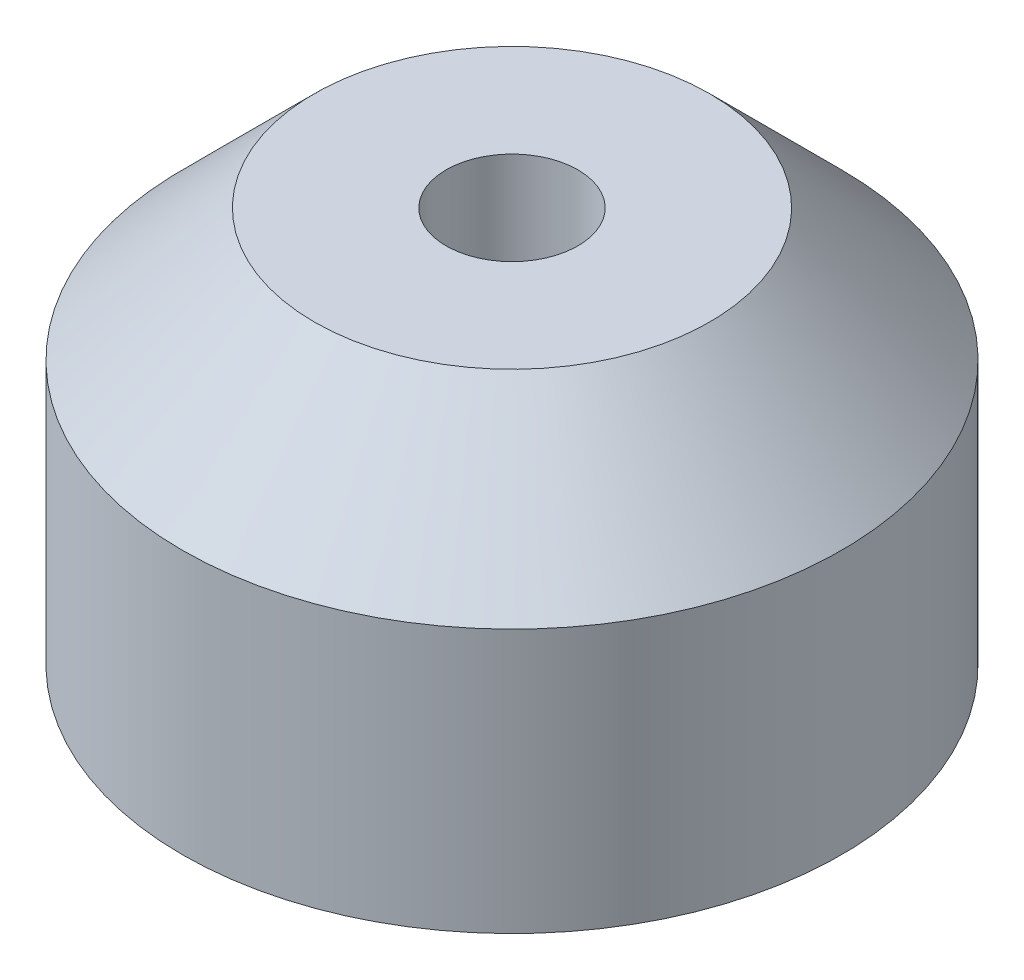
ISO-10303-21;
HEADER;
FILE_DESCRIPTION(('STEP AP214'),'2;1');
FILE_NAME('part.step','',(''),(''),'','','');
FILE_SCHEMA(('AUTOMOTIVE_DESIGN { 1 0 10303 214 1 1 1 1 }'));
ENDSEC;
DATA;
#1=APPLICATION_CONTEXT('core data for automotive mechanical design processes');
#2=APPLICATION_PROTOCOL_DEFINITION('international standard','automotive_design',2000,#1);
#3=PRODUCT_CONTEXT('',#1,'mechanical');
#4=PRODUCT('Part','Part','',(#3));
#5=PRODUCT_RELATED_PRODUCT_CATEGORY('part','',(#4));
#6=PRODUCT_DEFINITION_FORMATION('','',#4);
#7=PRODUCT_DEFINITION_CONTEXT('part definition',#1,'design');
#8=PRODUCT_DEFINITION('design','',#6,#7);
#9=PRODUCT_DEFINITION_SHAPE('','',#8);
#10=(LENGTH_UNIT() NAMED_UNIT(*) SI_UNIT(.MILLI.,.METRE.));
#11=(NAMED_UNIT(*) PLANE_ANGLE_UNIT() SI_UNIT($,.RADIAN.));
#12=(NAMED_UNIT(*) SI_UNIT($,.STERADIAN.) SOLID_ANGLE_UNIT());
#13=UNCERTAINTY_MEASURE_WITH_UNIT(LENGTH_MEASURE(1.E-05),#10,'distance_accuracy_value','');
#14=(GEOMETRIC_REPRESENTATION_CONTEXT(3) GLOBAL_UNCERTAINTY_ASSIGNED_CONTEXT((#13)) GLOBAL_UNIT_ASSIGNED_CONTEXT((#10,
#11,#12)) REPRESENTATION_CONTEXT('',''));
#15=CARTESIAN_POINT('',(0.,0.,0.));
#16=DIRECTION('',(0.,0.,1.));
#17=DIRECTION('',(1.,0.,0.));
#18=AXIS2_PLACEMENT_3D('',#15,#16,#17);
#19=CARTESIAN_POINT('',(0.,-6.99999999999999,0.));
#20=DIRECTION('',(0.,1.,0.));
#21=DIRECTION('',(-1.,0.,0.));
#22=AXIS2_PLACEMENT_3D('',#19,#20,#21);
#23=PLANE('',#22);
#24=CARTESIAN_POINT('',(0.,-7.,0.));
#25=DIRECTION('',(0.,1.,0.));
#26=DIRECTION('',(0.,0.,1.));
#27=AXIS2_PLACEMENT_3D('',#24,#25,#26);
#28=CIRCLE('',#27,3.);
#29=CARTESIAN_POINT('',(0.,-7.,3.));
#30=VERTEX_POINT('',#29);
#31=EDGE_CURVE('E36',#30,#30,#28,.T.);
#32=ORIENTED_EDGE('',*,*,#31,.T.);
#33=EDGE_LOOP('',(#32));
#34=FACE_BOUND('',#33,.T.);
#35=CARTESIAN_POINT('',(0.,-6.99999999999999,0.));
#36=DIRECTION('',(0.,1.,0.));
#37=DIRECTION('',(-1.,0.,0.));
#38=AXIS2_PLACEMENT_3D('',#35,#36,#37);
#39=CIRCLE('',#38,1.);
#40=CARTESIAN_POINT('',(-1.,-6.99999999999999,0.));
#41=VERTEX_POINT('',#40);
#42=EDGE_CURVE('E48',#41,#41,#39,.F.);
#43=ORIENTED_EDGE('',*,*,#42,.T.);
#44=EDGE_LOOP('',(#43));
#45=FACE_BOUND('',#44,.T.);
#46=ADVANCED_FACE('F32',(#34,#45),#23,.T.);
#47=CARTESIAN_POINT('',(0.,-13.,0.));
#48=DIRECTION('',(0.,-1.,0.));
#49=DIRECTION('',(0.,0.,-1.));
#50=AXIS2_PLACEMENT_3D('',#47,#48,#49);
#51=PLANE('',#50);
#52=CARTESIAN_POINT('',(0.,-13.,0.));
#53=DIRECTION('',(0.,-1.,0.));
#54=DIRECTION('',(0.,0.,-1.));
#55=AXIS2_PLACEMENT_3D('',#52,#53,#54);
#56=CIRCLE('',#55,5.);
#57=CARTESIAN_POINT('',(0.,-13.,-5.));
#58=VERTEX_POINT('',#57);
#59=EDGE_CURVE('E45',#58,#58,#56,.T.);
#60=ORIENTED_EDGE('',*,*,#59,.T.);
#61=EDGE_LOOP('',(#60));
#62=FACE_BOUND('',#61,.T.);
#63=CARTESIAN_POINT('',(0.,-13.,0.));
#64=DIRECTION('',(0.,-1.,0.));
#65=DIRECTION('',(0.,0.,-1.));
#66=AXIS2_PLACEMENT_3D('',#63,#64,#65);
#67=CIRCLE('',#66,2.5);
#68=CARTESIAN_POINT('',(0.,-13.,-2.5));
#69=VERTEX_POINT('',#68);
#70=EDGE_CURVE('E40',#69,#69,#67,.T.);
#71=ORIENTED_EDGE('',*,*,#70,.F.);
#72=EDGE_LOOP('',(#71));
#73=FACE_BOUND('',#72,.T.);
#74=ADVANCED_FACE('F73',(#62,#73),#51,.T.);
#75=CARTESIAN_POINT('',(0.,-9.,0.));
#76=DIRECTION('',(0.,-1.,0.));
#77=DIRECTION('',(0.,0.,-1.));
#78=AXIS2_PLACEMENT_3D('',#75,#76,#77);
#79=CYLINDRICAL_SURFACE('',#78,5.);
#80=CARTESIAN_POINT('',(0.,-9.,0.));
#81=DIRECTION('',(0.,1.,0.));
#82=DIRECTION('',(0.,0.,1.));
#83=AXIS2_PLACEMENT_3D('',#80,#81,#82);
#84=CIRCLE('',#83,5.);
#85=CARTESIAN_POINT('',(0.,-9.,5.));
#86=VERTEX_POINT('',#85);
#87=EDGE_CURVE('E54',#86,#86,#84,.T.);
#88=ORIENTED_EDGE('',*,*,#87,.F.);
#89=EDGE_LOOP('',(#88));
#90=FACE_BOUND('',#89,.T.);
#91=ORIENTED_EDGE('',*,*,#59,.F.);
#92=EDGE_LOOP('',(#91));
#93=FACE_BOUND('',#92,.T.);
#94=ADVANCED_FACE('F63',(#90,#93),#79,.T.);
#95=CARTESIAN_POINT('',(0.,-7.,0.));
#96=DIRECTION('',(0.,-1.,0.));
#97=DIRECTION('',(0.,0.,-1.));
#98=AXIS2_PLACEMENT_3D('',#95,#96,#97);
#99=CONICAL_SURFACE('',#98,3.,0.785398163397442);
#100=ORIENTED_EDGE('',*,*,#87,.T.);
#101=EDGE_LOOP('',(#100));
#102=FACE_BOUND('',#101,.T.);
#103=ORIENTED_EDGE('',*,*,#31,.F.);
#104=EDGE_LOOP('',(#103));
#105=FACE_BOUND('',#104,.T.);
#106=ADVANCED_FACE('F60',(#102,#105),#99,.T.);
#107=CARTESIAN_POINT('',(0.,-13.,0.));
#108=DIRECTION('',(0.,1.,0.));
#109=DIRECTION('',(0.,0.,1.));
#110=AXIS2_PLACEMENT_3D('',#107,#108,#109);
#111=CYLINDRICAL_SURFACE('',#110,2.5);
#112=ORIENTED_EDGE('',*,*,#70,.T.);
#113=EDGE_LOOP('',(#112));
#114=FACE_BOUND('',#113,.T.);
#115=CARTESIAN_POINT('',(0.,-10.,0.));
#116=DIRECTION('',(0.,-1.,0.));
#117=DIRECTION('',(0.,0.,-1.));
#118=AXIS2_PLACEMENT_3D('',#115,#116,#117);
#119=CIRCLE('',#118,2.5);
#120=CARTESIAN_POINT('',(0.,-10.,-2.5));
#121=VERTEX_POINT('',#120);
#122=EDGE_CURVE('E50',#121,#121,#119,.F.);
#123=ORIENTED_EDGE('',*,*,#122,.T.);
#124=EDGE_LOOP('',(#123));
#125=FACE_BOUND('',#124,.T.);
#126=ADVANCED_FACE('F62',(#114,#125),#111,.F.);
#127=CARTESIAN_POINT('',(0.,-10.,0.));
#128=DIRECTION('',(0.,-1.,0.));
#129=DIRECTION('',(0.,0.,-1.));
#130=AXIS2_PLACEMENT_3D('',#127,#128,#129);
#131=PLANE('',#130);
#132=CARTESIAN_POINT('',(0.,-10.,0.));
#133=DIRECTION('',(0.,-1.,0.));
#134=DIRECTION('',(0.,0.,-1.));
#135=AXIS2_PLACEMENT_3D('',#132,#133,#134);
#136=CIRCLE('',#135,1.);
#137=CARTESIAN_POINT('',(0.,-10.,-1.));
#138=VERTEX_POINT('',#137);
#139=EDGE_CURVE('E10',#138,#138,#136,.T.);
#140=ORIENTED_EDGE('',*,*,#139,.F.);
#141=EDGE_LOOP('',(#140));
#142=FACE_BOUND('',#141,.T.);
#143=ORIENTED_EDGE('',*,*,#122,.F.);
#144=EDGE_LOOP('',(#143));
#145=FACE_BOUND('',#144,.T.);
#146=ADVANCED_FACE('F70',(#142,#145),#131,.T.);
#147=CARTESIAN_POINT('',(0.,-2.,0.));
#148=DIRECTION('',(0.,-1.,0.));
#149=DIRECTION('',(0.,0.,-1.));
#150=AXIS2_PLACEMENT_3D('',#147,#148,#149);
#151=CYLINDRICAL_SURFACE('',#150,1.);
#152=ORIENTED_EDGE('',*,*,#139,.T.);
#153=EDGE_LOOP('',(#152));
#154=FACE_BOUND('',#153,.T.);
#155=ORIENTED_EDGE('',*,*,#42,.F.);
#156=EDGE_LOOP('',(#155));
#157=FACE_BOUND('',#156,.T.);
#158=ADVANCED_FACE('F34',(#154,#157),#151,.F.);
#159=CLOSED_SHELL('',(#46,#74,#94,#106,#126,#146,#158));
#160=MANIFOLD_SOLID_BREP('B2',#159);
#161=ADVANCED_BREP_SHAPE_REPRESENTATION('',(#18,#160),#14);
#162=SHAPE_DEFINITION_REPRESENTATION(#9,#161);
ENDSEC;
END-ISO-10303-21;
